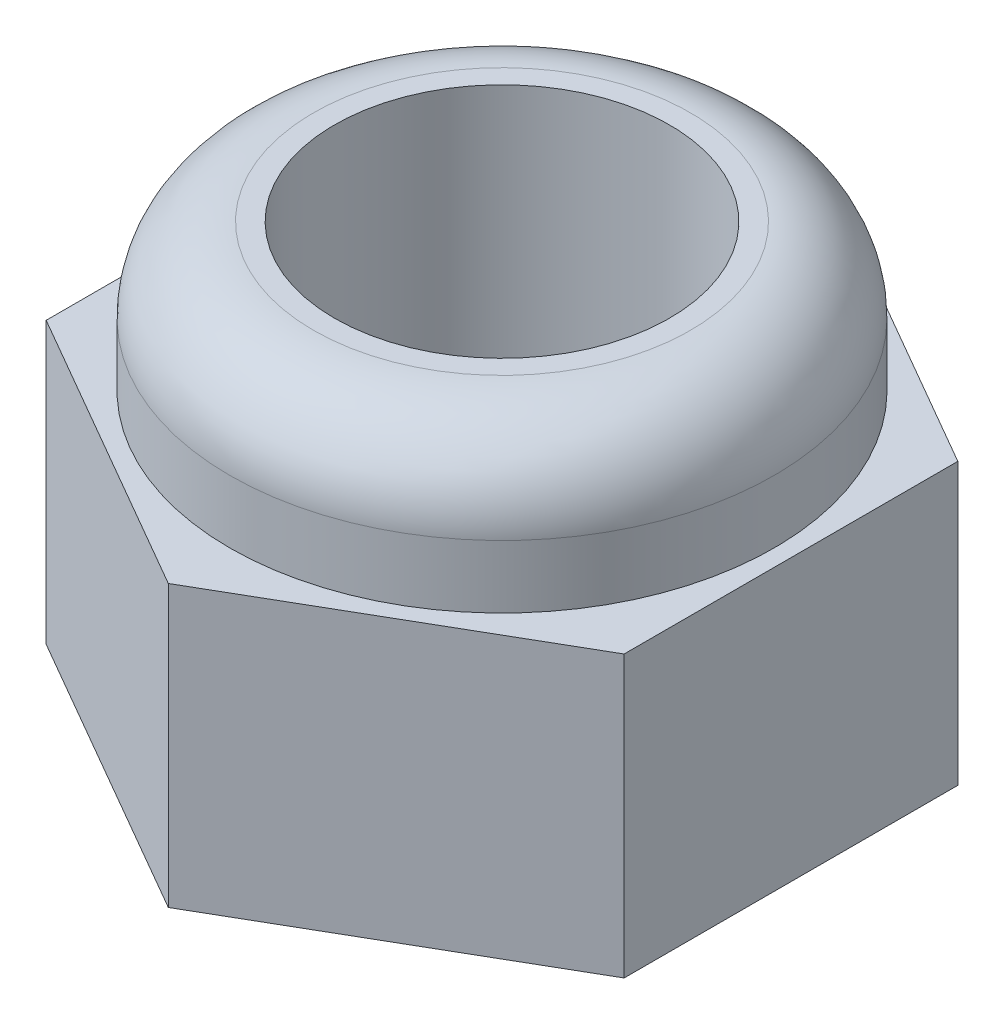
ISO-10303-21;
HEADER;
FILE_DESCRIPTION(('STEP AP214'),'2;1');
FILE_NAME('part.step','',(''),(''),'','','');
FILE_SCHEMA(('AUTOMOTIVE_DESIGN { 1 0 10303 214 1 1 1 1 }'));
ENDSEC;
DATA;
#1=APPLICATION_CONTEXT('core data for automotive mechanical design processes');
#2=APPLICATION_PROTOCOL_DEFINITION('international standard','automotive_design',2000,#1);
#3=PRODUCT_CONTEXT('',#1,'mechanical');
#4=PRODUCT('Part','Part','',(#3));
#5=PRODUCT_RELATED_PRODUCT_CATEGORY('part','',(#4));
#6=PRODUCT_DEFINITION_FORMATION('','',#4);
#7=PRODUCT_DEFINITION_CONTEXT('part definition',#1,'design');
#8=PRODUCT_DEFINITION('design','',#6,#7);
#9=PRODUCT_DEFINITION_SHAPE('','',#8);
#10=(LENGTH_UNIT() NAMED_UNIT(*) SI_UNIT(.MILLI.,.METRE.));
#11=(NAMED_UNIT(*) PLANE_ANGLE_UNIT() SI_UNIT($,.RADIAN.));
#12=(NAMED_UNIT(*) SI_UNIT($,.STERADIAN.) SOLID_ANGLE_UNIT());
#13=UNCERTAINTY_MEASURE_WITH_UNIT(LENGTH_MEASURE(1.E-05),#10,'distance_accuracy_value','');
#14=(GEOMETRIC_REPRESENTATION_CONTEXT(3) GLOBAL_UNCERTAINTY_ASSIGNED_CONTEXT((#13)) GLOBAL_UNIT_ASSIGNED_CONTEXT((#10,
#11,#12)) REPRESENTATION_CONTEXT('',''));
#15=CARTESIAN_POINT('',(0.,0.,0.));
#16=DIRECTION('',(0.,0.,1.));
#17=DIRECTION('',(1.,0.,0.));
#18=AXIS2_PLACEMENT_3D('',#15,#16,#17);
#19=CARTESIAN_POINT('',(0.,3.35,0.));
#20=DIRECTION('',(0.,1.,0.));
#21=DIRECTION('',(0.,0.,1.));
#22=AXIS2_PLACEMENT_3D('',#19,#20,#21);
#23=PLANE('',#22);
#24=CARTESIAN_POINT('',(0.,3.35,0.));
#25=DIRECTION('',(0.,1.,0.));
#26=DIRECTION('',(0.,0.,1.));
#27=AXIS2_PLACEMENT_3D('',#24,#25,#26);
#28=CIRCLE('',#27,3.25);
#29=CARTESIAN_POINT('',(0.,3.35,3.25));
#30=VERTEX_POINT('',#29);
#31=EDGE_CURVE('E136',#30,#30,#28,.T.);
#32=ORIENTED_EDGE('',*,*,#31,.F.);
#33=EDGE_LOOP('',(#32));
#34=FACE_BOUND('',#33,.T.);
#35=DIRECTION('',(-0.866025403784442,0.,-0.499999999999995));
#36=VECTOR('',#35,1.);
#37=CARTESIAN_POINT('',(3.44999999999997,3.35,-1.99185842870425));
#38=LINE('',#37,#36);
#39=CARTESIAN_POINT('',(3.44999999999997,3.35,-1.99185842870425));
#40=VERTEX_POINT('',#39);
#41=CARTESIAN_POINT('',(0.,3.35,-3.98371685740841));
#42=VERTEX_POINT('',#41);
#43=EDGE_CURVE('E128',#40,#42,#38,.T.);
#44=ORIENTED_EDGE('',*,*,#43,.T.);
#45=DIRECTION('',(-0.866025403784438,0.,0.500000000000001));
#46=VECTOR('',#45,1.);
#47=CARTESIAN_POINT('',(0.,3.35,-3.98371685740841));
#48=LINE('',#47,#46);
#49=CARTESIAN_POINT('',(-3.45,3.35,-1.9918584287042));
#50=VERTEX_POINT('',#49);
#51=EDGE_CURVE('E87',#42,#50,#48,.T.);
#52=ORIENTED_EDGE('',*,*,#51,.T.);
#53=DIRECTION('',(0.,0.,1.));
#54=VECTOR('',#53,1.);
#55=CARTESIAN_POINT('',(-3.45,3.35,-1.9918584287042));
#56=LINE('',#55,#54);
#57=CARTESIAN_POINT('',(-3.44999999999999,3.35,1.99185842870422));
#58=VERTEX_POINT('',#57);
#59=EDGE_CURVE('E99',#50,#58,#56,.T.);
#60=ORIENTED_EDGE('',*,*,#59,.T.);
#61=DIRECTION('',(0.866025403784442,0.,0.499999999999995));
#62=VECTOR('',#61,1.);
#63=CARTESIAN_POINT('',(-3.44999999999999,3.35,1.99185842870422));
#64=LINE('',#63,#62);
#65=CARTESIAN_POINT('',(0.,3.35,3.98371685740841));
#66=VERTEX_POINT('',#65);
#67=EDGE_CURVE('E94',#58,#66,#64,.T.);
#68=ORIENTED_EDGE('',*,*,#67,.T.);
#69=DIRECTION('',(0.866025403784435,0.,-0.500000000000007));
#70=VECTOR('',#69,1.);
#71=CARTESIAN_POINT('',(0.,3.35,3.98371685740841));
#72=LINE('',#71,#70);
#73=CARTESIAN_POINT('',(3.45000000000001,3.35,1.99185842870417));
#74=VERTEX_POINT('',#73);
#75=EDGE_CURVE('E97',#66,#74,#72,.T.);
#76=ORIENTED_EDGE('',*,*,#75,.T.);
#77=DIRECTION('',(0.,0.,-1.));
#78=VECTOR('',#77,1.);
#79=CARTESIAN_POINT('',(3.45000000000001,3.35,1.99185842870417));
#80=LINE('',#79,#78);
#81=EDGE_CURVE('E49',#74,#40,#80,.T.);
#82=ORIENTED_EDGE('',*,*,#81,.T.);
#83=EDGE_LOOP('',(#44,#52,#60,#68,#76,#82));
#84=FACE_BOUND('',#83,.T.);
#85=ADVANCED_FACE('F32',(#34,#84),#23,.T.);
#86=CARTESIAN_POINT('',(0.,0.,0.));
#87=DIRECTION('',(0.,1.,0.));
#88=DIRECTION('',(0.,0.,1.));
#89=AXIS2_PLACEMENT_3D('',#86,#87,#88);
#90=PLANE('',#89);
#91=DIRECTION('',(-0.866025403784442,0.,-0.499999999999995));
#92=VECTOR('',#91,1.);
#93=CARTESIAN_POINT('',(3.44999999999997,0.,-1.99185842870425));
#94=LINE('',#93,#92);
#95=CARTESIAN_POINT('',(3.44999999999997,0.,-1.99185842870425));
#96=VERTEX_POINT('',#95);
#97=CARTESIAN_POINT('',(0.,0.,-3.98371685740841));
#98=VERTEX_POINT('',#97);
#99=EDGE_CURVE('E117',#96,#98,#94,.T.);
#100=ORIENTED_EDGE('',*,*,#99,.F.);
#101=DIRECTION('',(0.,0.,-1.));
#102=VECTOR('',#101,1.);
#103=CARTESIAN_POINT('',(3.45000000000001,0.,1.99185842870417));
#104=LINE('',#103,#102);
#105=CARTESIAN_POINT('',(3.45000000000001,0.,1.99185842870417));
#106=VERTEX_POINT('',#105);
#107=EDGE_CURVE('E78',#106,#96,#104,.T.);
#108=ORIENTED_EDGE('',*,*,#107,.F.);
#109=DIRECTION('',(0.866025403784435,0.,-0.500000000000007));
#110=VECTOR('',#109,1.);
#111=CARTESIAN_POINT('',(0.,0.,3.98371685740841));
#112=LINE('',#111,#110);
#113=CARTESIAN_POINT('',(0.,0.,3.98371685740841));
#114=VERTEX_POINT('',#113);
#115=EDGE_CURVE('E72',#114,#106,#112,.T.);
#116=ORIENTED_EDGE('',*,*,#115,.F.);
#117=DIRECTION('',(0.866025403784442,0.,0.499999999999995));
#118=VECTOR('',#117,1.);
#119=CARTESIAN_POINT('',(-3.44999999999999,0.,1.99185842870422));
#120=LINE('',#119,#118);
#121=CARTESIAN_POINT('',(-3.44999999999999,0.,1.99185842870422));
#122=VERTEX_POINT('',#121);
#123=EDGE_CURVE('E107',#122,#114,#120,.T.);
#124=ORIENTED_EDGE('',*,*,#123,.F.);
#125=DIRECTION('',(0.,0.,1.));
#126=VECTOR('',#125,1.);
#127=CARTESIAN_POINT('',(-3.45,0.,-1.9918584287042));
#128=LINE('',#127,#126);
#129=CARTESIAN_POINT('',(-3.45,0.,-1.9918584287042));
#130=VERTEX_POINT('',#129);
#131=EDGE_CURVE('E123',#130,#122,#128,.T.);
#132=ORIENTED_EDGE('',*,*,#131,.F.);
#133=DIRECTION('',(-0.866025403784438,0.,0.500000000000001));
#134=VECTOR('',#133,1.);
#135=CARTESIAN_POINT('',(0.,0.,-3.98371685740841));
#136=LINE('',#135,#134);
#137=EDGE_CURVE('E120',#98,#130,#136,.T.);
#138=ORIENTED_EDGE('',*,*,#137,.F.);
#139=EDGE_LOOP('',(#100,#108,#116,#124,#132,#138));
#140=FACE_BOUND('',#139,.T.);
#141=CARTESIAN_POINT('',(0.,0.,0.));
#142=DIRECTION('',(0.,1.,0.));
#143=DIRECTION('',(0.,0.,1.));
#144=AXIS2_PLACEMENT_3D('',#141,#142,#143);
#145=CIRCLE('',#144,2.);
#146=CARTESIAN_POINT('',(0.,0.,2.));
#147=VERTEX_POINT('',#146);
#148=EDGE_CURVE('E121',#147,#147,#145,.T.);
#149=ORIENTED_EDGE('',*,*,#148,.T.);
#150=EDGE_LOOP('',(#149));
#151=FACE_BOUND('',#150,.T.);
#152=ADVANCED_FACE('F158',(#140,#151),#90,.F.);
#153=CARTESIAN_POINT('',(3.44999999999997,3.35,-1.99185842870425));
#154=DIRECTION('',(-0.499999999999995,0.,0.866025403784442));
#155=DIRECTION('',(0.866025403784442,0.,0.499999999999995));
#156=AXIS2_PLACEMENT_3D('',#153,#154,#155);
#157=PLANE('',#156);
#158=ORIENTED_EDGE('',*,*,#99,.T.);
#159=DIRECTION('',(0.,-1.,0.));
#160=VECTOR('',#159,1.);
#161=CARTESIAN_POINT('',(0.,3.35,-3.98371685740841));
#162=LINE('',#161,#160);
#163=EDGE_CURVE('E135',#42,#98,#162,.T.);
#164=ORIENTED_EDGE('',*,*,#163,.F.);
#165=ORIENTED_EDGE('',*,*,#43,.F.);
#166=DIRECTION('',(0.,-1.,0.));
#167=VECTOR('',#166,1.);
#168=CARTESIAN_POINT('',(3.44999999999997,3.35,-1.99185842870425));
#169=LINE('',#168,#167);
#170=EDGE_CURVE('E113',#40,#96,#169,.T.);
#171=ORIENTED_EDGE('',*,*,#170,.T.);
#172=EDGE_LOOP('',(#158,#164,#165,#171));
#173=FACE_BOUND('',#172,.T.);
#174=ADVANCED_FACE('F161',(#173),#157,.F.);
#175=CARTESIAN_POINT('',(0.,3.35,-3.98371685740841));
#176=DIRECTION('',(0.500000000000001,0.,0.866025403784438));
#177=DIRECTION('',(0.866025403784438,0.,-0.500000000000001));
#178=AXIS2_PLACEMENT_3D('',#175,#176,#177);
#179=PLANE('',#178);
#180=ORIENTED_EDGE('',*,*,#137,.T.);
#181=DIRECTION('',(0.,-1.,0.));
#182=VECTOR('',#181,1.);
#183=CARTESIAN_POINT('',(-3.45,3.35,-1.9918584287042));
#184=LINE('',#183,#182);
#185=EDGE_CURVE('E132',#50,#130,#184,.T.);
#186=ORIENTED_EDGE('',*,*,#185,.F.);
#187=ORIENTED_EDGE('',*,*,#51,.F.);
#188=ORIENTED_EDGE('',*,*,#163,.T.);
#189=EDGE_LOOP('',(#180,#186,#187,#188));
#190=FACE_BOUND('',#189,.T.);
#191=ADVANCED_FACE('F152',(#190),#179,.F.);
#192=CARTESIAN_POINT('',(-3.45,3.35,-1.9918584287042));
#193=DIRECTION('',(1.,0.,0.));
#194=DIRECTION('',(0.,0.,-1.));
#195=AXIS2_PLACEMENT_3D('',#192,#193,#194);
#196=PLANE('',#195);
#197=ORIENTED_EDGE('',*,*,#131,.T.);
#198=DIRECTION('',(0.,-1.,0.));
#199=VECTOR('',#198,1.);
#200=CARTESIAN_POINT('',(-3.44999999999999,3.35,1.99185842870422));
#201=LINE('',#200,#199);
#202=EDGE_CURVE('E108',#58,#122,#201,.T.);
#203=ORIENTED_EDGE('',*,*,#202,.F.);
#204=ORIENTED_EDGE('',*,*,#59,.F.);
#205=ORIENTED_EDGE('',*,*,#185,.T.);
#206=EDGE_LOOP('',(#197,#203,#204,#205));
#207=FACE_BOUND('',#206,.T.);
#208=ADVANCED_FACE('F155',(#207),#196,.F.);
#209=CARTESIAN_POINT('',(-3.44999999999999,3.35,1.99185842870422));
#210=DIRECTION('',(0.499999999999995,0.,-0.866025403784441));
#211=DIRECTION('',(-0.866025403784442,0.,-0.499999999999995));
#212=AXIS2_PLACEMENT_3D('',#209,#210,#211);
#213=PLANE('',#212);
#214=ORIENTED_EDGE('',*,*,#123,.T.);
#215=DIRECTION('',(0.,-1.,0.));
#216=VECTOR('',#215,1.);
#217=CARTESIAN_POINT('',(0.,3.35,3.98371685740841));
#218=LINE('',#217,#216);
#219=EDGE_CURVE('E104',#66,#114,#218,.T.);
#220=ORIENTED_EDGE('',*,*,#219,.F.);
#221=ORIENTED_EDGE('',*,*,#67,.F.);
#222=ORIENTED_EDGE('',*,*,#202,.T.);
#223=EDGE_LOOP('',(#214,#220,#221,#222));
#224=FACE_BOUND('',#223,.T.);
#225=ADVANCED_FACE('F105',(#224),#213,.F.);
#226=CARTESIAN_POINT('',(0.,3.35,3.98371685740841));
#227=DIRECTION('',(-0.500000000000007,0.,-0.866025403784435));
#228=DIRECTION('',(-0.866025403784435,0.,0.500000000000007));
#229=AXIS2_PLACEMENT_3D('',#226,#227,#228);
#230=PLANE('',#229);
#231=ORIENTED_EDGE('',*,*,#115,.T.);
#232=DIRECTION('',(0.,-1.,0.));
#233=VECTOR('',#232,1.);
#234=CARTESIAN_POINT('',(3.45000000000001,3.35,1.99185842870417));
#235=LINE('',#234,#233);
#236=EDGE_CURVE('E109',#74,#106,#235,.T.);
#237=ORIENTED_EDGE('',*,*,#236,.F.);
#238=ORIENTED_EDGE('',*,*,#75,.F.);
#239=ORIENTED_EDGE('',*,*,#219,.T.);
#240=EDGE_LOOP('',(#231,#237,#238,#239));
#241=FACE_BOUND('',#240,.T.);
#242=ADVANCED_FACE('F111',(#241),#230,.F.);
#243=CARTESIAN_POINT('',(3.45000000000001,3.35,1.99185842870417));
#244=DIRECTION('',(-1.,0.,0.));
#245=DIRECTION('',(0.,0.,1.));
#246=AXIS2_PLACEMENT_3D('',#243,#244,#245);
#247=PLANE('',#246);
#248=ORIENTED_EDGE('',*,*,#107,.T.);
#249=ORIENTED_EDGE('',*,*,#170,.F.);
#250=ORIENTED_EDGE('',*,*,#81,.F.);
#251=ORIENTED_EDGE('',*,*,#236,.T.);
#252=EDGE_LOOP('',(#248,#249,#250,#251));
#253=FACE_BOUND('',#252,.T.);
#254=ADVANCED_FACE('F162',(#253),#247,.F.);
#255=CARTESIAN_POINT('',(0.,3.35,0.));
#256=DIRECTION('',(0.,-1.,0.));
#257=DIRECTION('',(0.,0.,-1.));
#258=AXIS2_PLACEMENT_3D('',#255,#256,#257);
#259=CYLINDRICAL_SURFACE('',#258,2.);
#260=ORIENTED_EDGE('',*,*,#148,.F.);
#261=EDGE_LOOP('',(#260));
#262=FACE_BOUND('',#261,.T.);
#263=CARTESIAN_POINT('',(0.,5.1,0.));
#264=DIRECTION('',(0.,1.,0.));
#265=DIRECTION('',(0.,0.,1.));
#266=AXIS2_PLACEMENT_3D('',#263,#264,#265);
#267=CIRCLE('',#266,2.);
#268=CARTESIAN_POINT('',(0.,5.1,2.));
#269=VERTEX_POINT('',#268);
#270=EDGE_CURVE('E146',#269,#269,#267,.T.);
#271=ORIENTED_EDGE('',*,*,#270,.T.);
#272=EDGE_LOOP('',(#271));
#273=FACE_BOUND('',#272,.T.);
#274=ADVANCED_FACE('F164',(#262,#273),#259,.F.);
#275=CARTESIAN_POINT('',(0.,5.1,0.));
#276=DIRECTION('',(0.,1.,0.));
#277=DIRECTION('',(0.,0.,1.));
#278=AXIS2_PLACEMENT_3D('',#275,#276,#277);
#279=PLANE('',#278);
#280=CARTESIAN_POINT('',(0.,5.1,0.));
#281=DIRECTION('',(0.,1.,0.));
#282=DIRECTION('',(0.,0.,1.));
#283=AXIS2_PLACEMENT_3D('',#280,#281,#282);
#284=CIRCLE('',#283,2.25);
#285=CARTESIAN_POINT('',(0.,5.1,2.25));
#286=VERTEX_POINT('',#285);
#287=EDGE_CURVE('E41',#286,#286,#284,.T.);
#288=ORIENTED_EDGE('',*,*,#287,.T.);
#289=EDGE_LOOP('',(#288));
#290=FACE_BOUND('',#289,.T.);
#291=ORIENTED_EDGE('',*,*,#270,.F.);
#292=EDGE_LOOP('',(#291));
#293=FACE_BOUND('',#292,.T.);
#294=ADVANCED_FACE('F170',(#290,#293),#279,.T.);
#295=CARTESIAN_POINT('',(0.,5.1,0.));
#296=DIRECTION('',(0.,-1.,0.));
#297=DIRECTION('',(0.,0.,-1.));
#298=AXIS2_PLACEMENT_3D('',#295,#296,#297);
#299=CYLINDRICAL_SURFACE('',#298,3.25);
#300=CARTESIAN_POINT('',(0.,4.1,0.));
#301=DIRECTION('',(0.,1.,0.));
#302=DIRECTION('',(0.,0.,1.));
#303=AXIS2_PLACEMENT_3D('',#300,#301,#302);
#304=CIRCLE('',#303,3.25);
#305=CARTESIAN_POINT('',(0.,4.1,3.25));
#306=VERTEX_POINT('',#305);
#307=EDGE_CURVE('E11',#306,#306,#304,.F.);
#308=ORIENTED_EDGE('',*,*,#307,.T.);
#309=EDGE_LOOP('',(#308));
#310=FACE_BOUND('',#309,.T.);
#311=ORIENTED_EDGE('',*,*,#31,.T.);
#312=EDGE_LOOP('',(#311));
#313=FACE_BOUND('',#312,.T.);
#314=ADVANCED_FACE('F182',(#310,#313),#299,.T.);
#315=CARTESIAN_POINT('',(0.,4.1,0.));
#316=DIRECTION('',(0.,1.,0.));
#317=DIRECTION('',(0.,0.,1.));
#318=AXIS2_PLACEMENT_3D('',#315,#316,#317);
#319=TOROIDAL_SURFACE('',#318,2.25,1.);
#320=ORIENTED_EDGE('',*,*,#307,.F.);
#321=EDGE_LOOP('',(#320));
#322=FACE_BOUND('',#321,.T.);
#323=ORIENTED_EDGE('',*,*,#287,.F.);
#324=EDGE_LOOP('',(#323));
#325=FACE_BOUND('',#324,.T.);
#326=ADVANCED_FACE('F34',(#322,#325),#319,.T.);
#327=CLOSED_SHELL('',(#85,#152,#174,#191,#208,#225,#242,#254,#274,#294,#314,#326));
#328=MANIFOLD_SOLID_BREP('B2',#327);
#329=ADVANCED_BREP_SHAPE_REPRESENTATION('',(#18,#328),#14);
#330=SHAPE_DEFINITION_REPRESENTATION(#9,#329);
ENDSEC;
END-ISO-10303-21;
